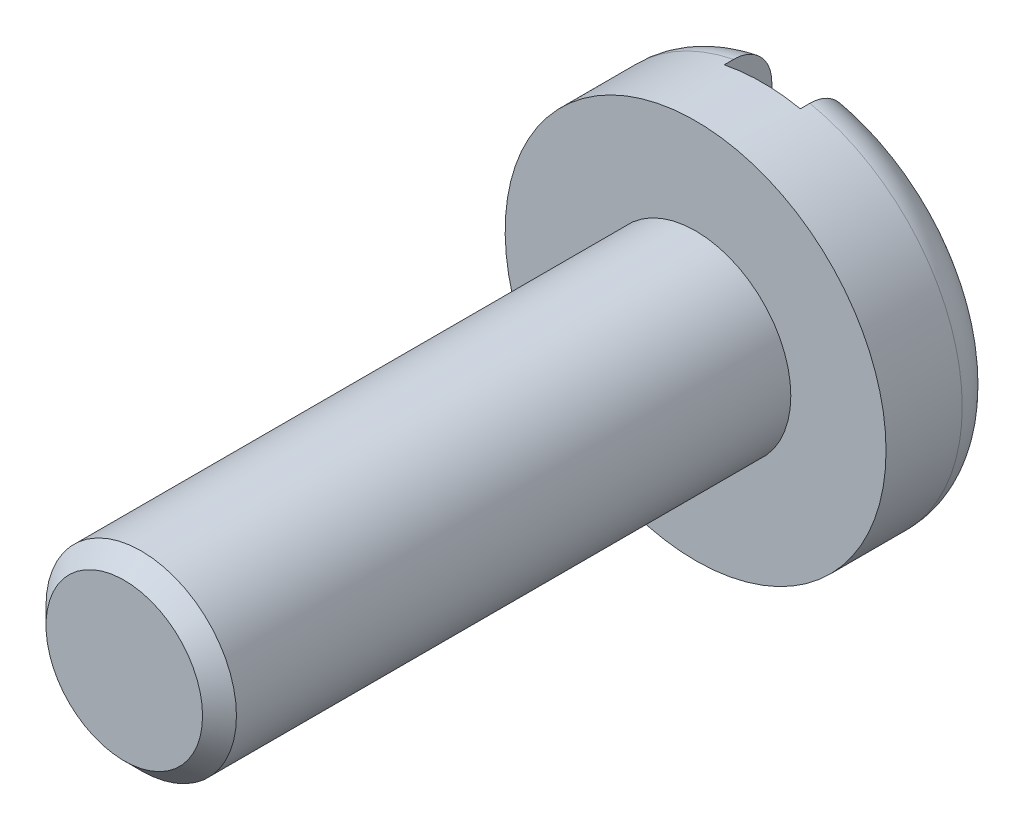
ISO-10303-21;
HEADER;
FILE_DESCRIPTION(('STEP AP214'),'2;1');
FILE_NAME('part.step','',(''),(''),'','','');
FILE_SCHEMA(('AUTOMOTIVE_DESIGN { 1 0 10303 214 1 1 1 1 }'));
ENDSEC;
DATA;
#1=APPLICATION_CONTEXT('core data for automotive mechanical design processes');
#2=APPLICATION_PROTOCOL_DEFINITION('international standard','automotive_design',2000,#1);
#3=PRODUCT_CONTEXT('',#1,'mechanical');
#4=PRODUCT('Part','Part','',(#3));
#5=PRODUCT_RELATED_PRODUCT_CATEGORY('part','',(#4));
#6=PRODUCT_DEFINITION_FORMATION('','',#4);
#7=PRODUCT_DEFINITION_CONTEXT('part definition',#1,'design');
#8=PRODUCT_DEFINITION('design','',#6,#7);
#9=PRODUCT_DEFINITION_SHAPE('','',#8);
#10=(LENGTH_UNIT() NAMED_UNIT(*) SI_UNIT(.MILLI.,.METRE.));
#11=(NAMED_UNIT(*) PLANE_ANGLE_UNIT() SI_UNIT($,.RADIAN.));
#12=(NAMED_UNIT(*) SI_UNIT($,.STERADIAN.) SOLID_ANGLE_UNIT());
#13=UNCERTAINTY_MEASURE_WITH_UNIT(LENGTH_MEASURE(1.E-05),#10,'distance_accuracy_value','');
#14=(GEOMETRIC_REPRESENTATION_CONTEXT(3) GLOBAL_UNCERTAINTY_ASSIGNED_CONTEXT((#13)) GLOBAL_UNIT_ASSIGNED_CONTEXT((#10,
#11,#12)) REPRESENTATION_CONTEXT('',''));
#15=CARTESIAN_POINT('',(0.,0.,0.));
#16=DIRECTION('',(0.,0.,1.));
#17=DIRECTION('',(1.,0.,0.));
#18=AXIS2_PLACEMENT_3D('',#15,#16,#17);
#19=CARTESIAN_POINT('',(0.,0.,0.));
#20=DIRECTION('',(0.,0.,1.));
#21=DIRECTION('',(1.,0.,0.));
#22=AXIS2_PLACEMENT_3D('',#19,#20,#21);
#23=PLANE('',#22);
#24=CARTESIAN_POINT('',(0.,0.,0.));
#25=DIRECTION('',(0.,0.,1.));
#26=DIRECTION('',(1.,0.,0.));
#27=AXIS2_PLACEMENT_3D('',#24,#25,#26);
#28=CIRCLE('',#27,4.);
#29=CARTESIAN_POINT('',(0.999999999999999,3.87298334620742,0.));
#30=VERTEX_POINT('',#29);
#31=CARTESIAN_POINT('',(0.999999999999999,-3.87298334620742,0.));
#32=VERTEX_POINT('',#31);
#33=EDGE_CURVE('E135',#30,#32,#28,.F.);
#34=ORIENTED_EDGE('',*,*,#33,.T.);
#35=DIRECTION('',(0.,1.,0.));
#36=VECTOR('',#35,1.);
#37=CARTESIAN_POINT('',(0.999999999999999,0.,0.));
#38=LINE('',#37,#36);
#39=EDGE_CURVE('E115',#32,#30,#38,.T.);
#40=ORIENTED_EDGE('',*,*,#39,.T.);
#41=EDGE_LOOP('',(#34,#40));
#42=FACE_BOUND('',#41,.T.);
#43=ADVANCED_FACE('F38',(#42),#23,.F.);
#44=CARTESIAN_POINT('',(0.,0.,1.));
#45=DIRECTION('',(0.,0.,1.));
#46=DIRECTION('',(1.,0.,0.));
#47=AXIS2_PLACEMENT_3D('',#44,#45,#46);
#48=TOROIDAL_SURFACE('',#47,4.,1.);
#49=CARTESIAN_POINT('',(0.999999999999999,-4.74089824241527,0.465574839603772));
#50=CARTESIAN_POINT('',(0.999999999999999,-4.77093906909583,0.51206702701001));
#51=CARTESIAN_POINT('',(0.999999999999999,-4.79711067903708,0.561102678447099));
#52=CARTESIAN_POINT('',(0.999999999999999,-4.84088596369063,0.662903994052508));
#53=CARTESIAN_POINT('',(0.999999999999999,-4.85848090806454,0.715673396580716));
#54=CARTESIAN_POINT('',(0.999999999999999,-4.88452978672489,0.823425083640973));
#55=CARTESIAN_POINT('',(0.999999999999999,-4.89298429664504,0.878407228595754));
#56=CARTESIAN_POINT('',(0.999999999999999,-4.90048364927595,0.988997037272202));
#57=CARTESIAN_POINT('',(0.999999999999999,-4.89953057800942,1.04460455959217));
#58=CARTESIAN_POINT('',(0.999999999999999,-4.8882807868657,1.15457059010988));
#59=CARTESIAN_POINT('',(0.999999999999999,-4.87803296373552,1.20893410986675));
#60=CARTESIAN_POINT('',(0.999999999999999,-4.84857983220366,1.31517705937444));
#61=CARTESIAN_POINT('',(0.999999999999999,-4.82937429620127,1.36705642597011));
#62=CARTESIAN_POINT('',(0.999999999999999,-4.78252772145242,1.46703140391835));
#63=CARTESIAN_POINT('',(0.999999999999999,-4.75486299230309,1.51511590558171));
#64=CARTESIAN_POINT('',(0.999999999999999,-4.69195239006159,1.60603553891727));
#65=CARTESIAN_POINT('',(0.999999999999999,-4.65670616379822,1.64887042589909));
#66=CARTESIAN_POINT('',(0.999999999999999,-4.57915929563324,1.72869929202435));
#67=CARTESIAN_POINT('',(0.999999999999999,-4.53677184786283,1.76560890237427));
#68=CARTESIAN_POINT('',(0.999999999999999,-4.44651378239344,1.83196438442698));
#69=CARTESIAN_POINT('',(0.999999999999999,-4.39864266087568,1.86140956952736));
#70=CARTESIAN_POINT('',(0.999999999999999,-4.29768563805518,1.912690559155));
#71=CARTESIAN_POINT('',(0.999999999999999,-4.24450972565911,1.93434908978383));
#72=CARTESIAN_POINT('',(0.999999999999999,-4.13533439460451,1.9686802440512));
#73=CARTESIAN_POINT('',(0.999999999999999,-4.07933461458573,1.98135171450631));
#74=CARTESIAN_POINT('',(0.999999999999999,-3.96457125808458,1.99768568641191));
#75=CARTESIAN_POINT('',(0.999999999999999,-3.90577363084606,2.00110903084919));
#76=CARTESIAN_POINT('',(0.999999999999999,-3.7884126545839,1.99826272601387));
#77=CARTESIAN_POINT('',(0.999999999999999,-3.72984933879538,1.99199174736522));
#78=CARTESIAN_POINT('',(0.999999999999999,-3.613268213964,1.96973618215348));
#79=CARTESIAN_POINT('',(0.999999999999999,-3.55529023657486,1.95354249044896));
#80=CARTESIAN_POINT('',(0.999999999999999,-3.44284084653008,1.91171023463247));
#81=CARTESIAN_POINT('',(0.999999999999999,-3.3883697828002,1.88607073239592));
#82=CARTESIAN_POINT('',(0.999999999999999,-3.28422225313787,1.82582762001542));
#83=CARTESIAN_POINT('',(0.999999999999999,-3.23457377181124,1.79117553669055));
#84=CARTESIAN_POINT('',(0.999999999999999,-3.14196876384408,1.713842252289));
#85=CARTESIAN_POINT('',(0.999999999999999,-3.09901174044189,1.67116164775493));
#86=CARTESIAN_POINT('',(0.999999999999999,-3.02220775407859,1.57998462898422));
#87=CARTESIAN_POINT('',(0.999999999999999,-2.98816883517039,1.5316502178449));
#88=CARTESIAN_POINT('',(0.999999999999999,-2.92919030253011,1.42971369977196));
#89=CARTESIAN_POINT('',(0.999999999999999,-2.90424742518487,1.37611349095908));
#90=CARTESIAN_POINT('',(0.999999999999999,-2.86551921866192,1.26804050353771));
#91=CARTESIAN_POINT('',(0.999999999999999,-2.85123849388488,1.21374526430384));
#92=CARTESIAN_POINT('',(0.999999999999999,-2.83246484792931,1.10349241104978));
#93=CARTESIAN_POINT('',(0.999999999999999,-2.82796880646208,1.04753533275381));
#94=CARTESIAN_POINT('',(0.999999999999999,-2.82893812506757,0.938164760828636));
#95=CARTESIAN_POINT('',(0.999999999999999,-2.83397680054707,0.884746962771905));
#96=CARTESIAN_POINT('',(0.999999999999999,-2.85296958556056,0.779526155630884));
#97=CARTESIAN_POINT('',(0.999999999999999,-2.86692347355491,0.727723106454245));
#98=CARTESIAN_POINT('',(0.999999999999999,-2.90317707406975,0.62720283956641));
#99=CARTESIAN_POINT('',(0.999999999999999,-2.92546742088583,0.578482230394738));
#100=CARTESIAN_POINT('',(0.999999999999999,-2.97760125095634,0.48527139927532));
#101=CARTESIAN_POINT('',(0.999999999999999,-3.00744601755024,0.440781897873544));
#102=CARTESIAN_POINT('',(0.999999999999999,-3.07509259167329,0.355344003704822));
#103=CARTESIAN_POINT('',(0.999999999999999,-3.11316807971552,0.314612481499972));
#104=CARTESIAN_POINT('',(0.999999999999999,-3.19532329186127,0.239740162341416));
#105=CARTESIAN_POINT('',(0.999999999999999,-3.2394044723506,0.20560096890261));
#106=CARTESIAN_POINT('',(0.999999999999999,-3.33470723090834,0.14311767029961));
#107=CARTESIAN_POINT('',(0.999999999999999,-3.38617614939443,0.115150438677534));
#108=CARTESIAN_POINT('',(0.999999999999999,-3.49297945352584,0.067959175273789));
#109=CARTESIAN_POINT('',(0.999999999999999,-3.54831453265273,0.0487367167295342));
#110=CARTESIAN_POINT('',(0.999999999999999,-3.66307362701856,0.0190822643418154));
#111=CARTESIAN_POINT('',(0.999999999999999,-3.72257051102004,0.00893131376428614));
#112=CARTESIAN_POINT('',(0.999999999999999,-3.84242579673291,-0.00125217946359011));
#113=CARTESIAN_POINT('',(0.999999999999999,-3.9027841982355,-0.00128472456621288));
#114=CARTESIAN_POINT('',(0.999999999999999,-4.02269182420806,0.00886219487331795));
#115=CARTESIAN_POINT('',(0.999999999999999,-4.08224035665226,0.0190498972791512));
#116=CARTESIAN_POINT('',(0.999999999999999,-4.19873146910034,0.0494817630717065));
#117=CARTESIAN_POINT('',(0.999999999999999,-4.2556736198033,0.06972757668119));
#118=CARTESIAN_POINT('',(0.999999999999999,-4.36414281303408,0.119321779303109));
#119=CARTESIAN_POINT('',(0.999999999999999,-4.41575180574797,0.148491064083182));
#120=CARTESIAN_POINT('',(0.999999999999999,-4.51311238926742,0.215283374984294));
#121=CARTESIAN_POINT('',(0.999999999999999,-4.55887194720193,0.252894705974579));
#122=CARTESIAN_POINT('',(0.999999999999999,-4.62736160475528,0.320058094017716));
#123=CARTESIAN_POINT('',(0.999999999999999,-4.65231431127167,0.347381814065032));
#124=CARTESIAN_POINT('',(0.999999999999999,-4.69905249332747,0.404617283436022));
#125=CARTESIAN_POINT('',(0.999999999999999,-4.72083802931435,0.43452898334908));
#126=CARTESIAN_POINT('',(0.999999999999999,-4.74089824241527,0.465574839603772));
#127=B_SPLINE_CURVE_WITH_KNOTS('',3,(#49,#50,#51,#52,#53,#54,#55,#56,#57,#58,#59,#60,#61,#62,
#63,#64,#65,#66,#67,#68,#69,#70,#71,#72,#73,#74,#75,#76,#77,#78,#79,#80,#81,#82,#83,#84,#85,#86,
#87,#88,#89,#90,#91,#92,#93,#94,#95,#96,#97,#98,#99,#100,#101,#102,#103,#104,#105,#106,#107,
#108,#109,#110,#111,#112,#113,#114,#115,#116,#117,#118,#119,#120,#121,#122,#123,#124,#125,#126),
.UNSPECIFIED.,.T.,.F.,(4,2,2,2,2,2,2,2,2,2,2,2,2,2,2,2,2,2,2,2,2,2,2,2,2,2,2,2,2,2,2,2,2,2,2,2,
2,2,4),(0.,0.165926564922769,0.332021678524293,0.498106331406758,0.664154157758893,
0.82933349370127,0.99451702680665,1.16016746881096,1.32582562903247,1.49366584887353,
1.66152150161308,1.83298720789472,2.00447491198791,2.18035666144788,2.35626253159434,
2.53600927491765,2.71577387486801,2.89652606583042,3.07726483167773,3.25371559012487,
3.43010297650855,3.59767353069205,3.76519063959225,3.92538799679189,4.08558137330303,
4.24559531645792,4.4056364609326,4.57217005850703,4.73874411274949,4.91367888365498,
5.08864511394687,5.26886084338837,5.44907652915315,5.62943759163489,5.80982825552668,
5.98681257878127,6.16355321494239,6.27435528518346,6.38515524041929),.UNSPECIFIED.);
#128=CARTESIAN_POINT('',(0.999999999999999,-4.89897948556991,1.00000000000064));
#129=VERTEX_POINT('',#128);
#130=EDGE_CURVE('E61',#32,#129,#127,.T.);
#131=ORIENTED_EDGE('',*,*,#130,.F.);
#132=ORIENTED_EDGE('',*,*,#33,.F.);
#133=CARTESIAN_POINT('',(0.999999999999999,2.93448378201662,0.563712357526974));
#134=CARTESIAN_POINT('',(0.999999999999999,2.91000701437085,0.611499699521355));
#135=CARTESIAN_POINT('',(0.999999999999999,2.88943587962965,0.6613192730997));
#136=CARTESIAN_POINT('',(0.999999999999999,2.85688814196943,0.763723114899403));
#137=CARTESIAN_POINT('',(0.999999999999999,2.84491671737472,0.816309028458516));
#138=CARTESIAN_POINT('',(0.999999999999999,2.83006066246026,0.922795059019514));
#139=CARTESIAN_POINT('',(0.999999999999999,2.8271824011816,0.976696070526368));
#140=CARTESIAN_POINT('',(0.999999999999999,2.83065505942636,1.08418986718175));
#141=CARTESIAN_POINT('',(0.999999999999999,2.83700451025153,1.13778270001759));
#142=CARTESIAN_POINT('',(0.999999999999999,2.85852543868406,1.24245417700771));
#143=CARTESIAN_POINT('',(0.999999999999999,2.8735849842021,1.29355596125553));
#144=CARTESIAN_POINT('',(0.999999999999999,2.91186043406805,1.39260230094927));
#145=CARTESIAN_POINT('',(0.999999999999999,2.9350773879355,1.44054644919567));
#146=CARTESIAN_POINT('',(0.999999999999999,2.98954837233285,1.53327223532849));
#147=CARTESIAN_POINT('',(0.999999999999999,3.02099187004184,1.57794236544402));
#148=CARTESIAN_POINT('',(0.999999999999999,3.09059404945473,1.66169746070875));
#149=CARTESIAN_POINT('',(0.999999999999999,3.12875423522928,1.70078117132914));
#150=CARTESIAN_POINT('',(0.999999999999999,3.21277099287321,1.77433657186925));
#151=CARTESIAN_POINT('',(0.999999999999999,3.2589190193294,1.80847544727498));
#152=CARTESIAN_POINT('',(0.999999999999999,3.35610501682304,1.86888755559914));
#153=CARTESIAN_POINT('',(0.999999999999999,3.40714406002746,1.89515905866895));
#154=CARTESIAN_POINT('',(0.999999999999999,3.51493663860159,1.94014213110062));
#155=CARTESIAN_POINT('',(0.999999999999999,3.57183891728481,1.95849801050286));
#156=CARTESIAN_POINT('',(0.999999999999999,3.68790012564205,1.98553945172235));
#157=CARTESIAN_POINT('',(0.999999999999999,3.74705928539265,1.9942240248639));
#158=CARTESIAN_POINT('',(0.999999999999999,3.86678683058724,2.00168514622703));
#159=CARTESIAN_POINT('',(0.999999999999999,3.92736351989617,2.00033007593359));
#160=CARTESIAN_POINT('',(0.999999999999999,4.04740864296231,1.98733987818855));
#161=CARTESIAN_POINT('',(0.999999999999999,4.1068771216297,1.97570516824781));
#162=CARTESIAN_POINT('',(0.999999999999999,4.22221655126588,1.94257877793046));
#163=CARTESIAN_POINT('',(0.999999999999999,4.27812271037955,1.92120988736992));
#164=CARTESIAN_POINT('',(0.999999999999999,4.38541897852354,1.86915599333329));
#165=CARTESIAN_POINT('',(0.999999999999999,4.4368096636758,1.83847218056493));
#166=CARTESIAN_POINT('',(0.999999999999999,4.53224912640572,1.76946640841065));
#167=CARTESIAN_POINT('',(0.999999999999999,4.57644808583963,1.73135219282969));
#168=CARTESIAN_POINT('',(0.999999999999999,4.65761246935788,1.64807163286058));
#169=CARTESIAN_POINT('',(0.999999999999999,4.6945789373752,1.60290630791939));
#170=CARTESIAN_POINT('',(0.999999999999999,4.75925187875461,1.50803971995027));
#171=CARTESIAN_POINT('',(0.999999999999999,4.78716840035085,1.45848160238852));
#172=CARTESIAN_POINT('',(0.999999999999999,4.83410331130973,1.35531690108024));
#173=CARTESIAN_POINT('',(0.999999999999999,4.85312271695606,1.30171078053451));
#174=CARTESIAN_POINT('',(0.999999999999999,4.8813849843533,1.19304353133181));
#175=CARTESIAN_POINT('',(0.999999999999999,4.89080246246899,1.13802776548886));
#176=CARTESIAN_POINT('',(0.999999999999999,4.90017893436993,1.02719713356779));
#177=CARTESIAN_POINT('',(0.999999999999999,4.90013853070775,0.971382318622866));
#178=CARTESIAN_POINT('',(0.999999999999999,4.89064282976504,0.861044631943875));
#179=CARTESIAN_POINT('',(0.999999999999999,4.88126827618146,0.806514785610181));
#180=CARTESIAN_POINT('',(0.999999999999999,4.85351703323853,0.699798298175667));
#181=CARTESIAN_POINT('',(0.999999999999999,4.83514041102996,0.647611639599051));
#182=CARTESIAN_POINT('',(0.999999999999999,4.7898963484848,0.546916340672522));
#183=CARTESIAN_POINT('',(0.999999999999999,4.76300931062551,0.49841651315801));
#184=CARTESIAN_POINT('',(0.999999999999999,4.70157102231077,0.40654588758618));
#185=CARTESIAN_POINT('',(0.999999999999999,4.66701943196387,0.363175317121159));
#186=CARTESIAN_POINT('',(0.999999999999999,4.59078648763996,0.28218375551089));
#187=CARTESIAN_POINT('',(0.999999999999999,4.54902009139599,0.244642852795113));
#188=CARTESIAN_POINT('',(0.999999999999999,4.45989016824042,0.176933955502939));
#189=CARTESIAN_POINT('',(0.999999999999999,4.41252611929278,0.146766649393012));
#190=CARTESIAN_POINT('',(0.999999999999999,4.31248365666993,0.0939644367849335));
#191=CARTESIAN_POINT('',(0.999999999999999,4.25971392738017,0.0715026113786261));
#192=CARTESIAN_POINT('',(0.999999999999999,4.15121403498489,0.0355099340098975));
#193=CARTESIAN_POINT('',(0.999999999999999,4.09548349400933,0.0219802249708486));
#194=CARTESIAN_POINT('',(0.999999999999999,3.98112357390738,0.00387475366064818));
#195=CARTESIAN_POINT('',(0.999999999999999,3.92245650859443,-0.00046302607484398));
#196=CARTESIAN_POINT('',(0.999999999999999,3.80520680768677,0.000541534748304016));
#197=CARTESIAN_POINT('',(0.999999999999999,3.74662418118805,0.0058848500380907));
#198=CARTESIAN_POINT('',(0.999999999999999,3.62983062174308,0.0262748614280143));
#199=CARTESIAN_POINT('',(0.999999999999999,3.57165669553844,0.0415339672258737));
#200=CARTESIAN_POINT('',(0.999999999999999,3.45864282796451,0.0815371173671725));
#201=CARTESIAN_POINT('',(0.999999999999999,3.40380404058364,0.106284423323527));
#202=CARTESIAN_POINT('',(0.999999999999999,3.29868362289936,0.164838892815233));
#203=CARTESIAN_POINT('',(0.999999999999999,3.24843699896355,0.198708947931725));
#204=CARTESIAN_POINT('',(0.999999999999999,3.15454628236655,0.274557510454423));
#205=CARTESIAN_POINT('',(0.999999999999999,3.11089402089954,0.316525836770678));
#206=CARTESIAN_POINT('',(0.999999999999999,3.04452347002882,0.392684680073623));
#207=CARTESIAN_POINT('',(0.999999999999999,3.0196067387943,0.424984987907534));
#208=CARTESIAN_POINT('',(0.999999999999999,2.97387209493399,0.492371194850656));
#209=CARTESIAN_POINT('',(0.999999999999999,2.95305389666677,0.527456899596257));
#210=CARTESIAN_POINT('',(0.999999999999999,2.93448378201662,0.563712357526974));
#211=B_SPLINE_CURVE_WITH_KNOTS('',3,(#133,#134,#135,#136,#137,#138,#139,#140,#141,#142,#143,
#144,#145,#146,#147,#148,#149,#150,#151,#152,#153,#154,#155,#156,#157,#158,#159,#160,#161,#162,
#163,#164,#165,#166,#167,#168,#169,#170,#171,#172,#173,#174,#175,#176,#177,#178,#179,#180,#181,
#182,#183,#184,#185,#186,#187,#188,#189,#190,#191,#192,#193,#194,#195,#196,#197,#198,#199,#200,
#201,#202,#203,#204,#205,#206,#207,#208,#209,#210),.UNSPECIFIED.,.T.,.F.,(4,2,2,2,2,2,2,2,2,2,2,
2,2,2,2,2,2,2,2,2,2,2,2,2,2,2,2,2,2,2,2,2,2,2,2,2,2,2,4),(0.,0.160932429040886,
0.321961682664087,0.483103699555348,0.644220071619469,0.803310565674792,0.962421535566603,
1.12558098044401,1.28877700827265,1.46021890091361,1.63169846193065,1.81023639217772,
1.98879257227755,2.1696937050775,2.3505874908574,2.5292600485585,2.70790977651708,
2.88213979820068,3.05634465305619,3.22615550479707,3.39594695495147,3.56259240299338,
3.72922723421693,3.89443302994594,4.05963759334406,4.22522538681189,4.39082052488689,
4.55852049840211,4.72623612394564,4.89750419570732,5.06879417810633,5.24446731371527,
5.42015813777703,5.59974239479571,5.77938844016696,5.96030613785517,6.14099785176801,
6.26310310975783,6.38519985478011),.UNSPECIFIED.);
#212=CARTESIAN_POINT('',(0.999999999999999,4.898979485567,0.99999999999989));
#213=VERTEX_POINT('',#212);
#214=EDGE_CURVE('E163',#213,#30,#211,.T.);
#215=ORIENTED_EDGE('',*,*,#214,.F.);
#216=CARTESIAN_POINT('',(0.,0.,1.));
#217=DIRECTION('',(0.,0.,1.));
#218=DIRECTION('',(1.,0.,0.));
#219=AXIS2_PLACEMENT_3D('',#216,#217,#218);
#220=CIRCLE('',#219,5.);
#221=EDGE_CURVE('E133',#129,#213,#220,.T.);
#222=ORIENTED_EDGE('',*,*,#221,.F.);
#223=EDGE_LOOP('',(#131,#132,#215,#222));
#224=FACE_BOUND('',#223,.T.);
#225=ADVANCED_FACE('F179',(#224),#48,.T.);
#226=CARTESIAN_POINT('',(0.,0.,3.));
#227=DIRECTION('',(0.,0.,1.));
#228=DIRECTION('',(1.,0.,0.));
#229=AXIS2_PLACEMENT_3D('',#226,#227,#228);
#230=PLANE('',#229);
#231=CARTESIAN_POINT('',(0.,0.,3.));
#232=DIRECTION('',(0.,0.,1.));
#233=DIRECTION('',(1.,0.,0.));
#234=AXIS2_PLACEMENT_3D('',#231,#232,#233);
#235=CIRCLE('',#234,5.);
#236=CARTESIAN_POINT('',(5.,0.,3.));
#237=VERTEX_POINT('',#236);
#238=EDGE_CURVE('E130',#237,#237,#235,.T.);
#239=ORIENTED_EDGE('',*,*,#238,.T.);
#240=EDGE_LOOP('',(#239));
#241=FACE_BOUND('',#240,.T.);
#242=CARTESIAN_POINT('',(0.,0.,3.));
#243=DIRECTION('',(0.,0.,1.));
#244=DIRECTION('',(1.,0.,0.));
#245=AXIS2_PLACEMENT_3D('',#242,#243,#244);
#246=CIRCLE('',#245,2.5);
#247=CARTESIAN_POINT('',(2.5,0.,3.));
#248=VERTEX_POINT('',#247);
#249=EDGE_CURVE('E127',#248,#248,#246,.T.);
#250=ORIENTED_EDGE('',*,*,#249,.F.);
#251=EDGE_LOOP('',(#250));
#252=FACE_BOUND('',#251,.T.);
#253=ADVANCED_FACE('F186',(#241,#252),#230,.T.);
#254=CARTESIAN_POINT('',(0.,0.,3.));
#255=DIRECTION('',(0.,0.,-1.));
#256=DIRECTION('',(-1.,0.,0.));
#257=AXIS2_PLACEMENT_3D('',#254,#255,#256);
#258=CYLINDRICAL_SURFACE('',#257,5.);
#259=ORIENTED_EDGE('',*,*,#221,.T.);
#260=DIRECTION('',(0.,0.,-1.));
#261=VECTOR('',#260,1.);
#262=CARTESIAN_POINT('',(0.999999999999999,4.89897948556636,3.));
#263=LINE('',#262,#261);
#264=CARTESIAN_POINT('',(0.999999999999999,4.89897948556636,1.25));
#265=VERTEX_POINT('',#264);
#266=EDGE_CURVE('E118',#213,#265,#263,.F.);
#267=ORIENTED_EDGE('',*,*,#266,.T.);
#268=CARTESIAN_POINT('',(0.,0.,1.25));
#269=DIRECTION('',(0.,0.,1.));
#270=DIRECTION('',(1.,0.,0.));
#271=AXIS2_PLACEMENT_3D('',#268,#269,#270);
#272=CIRCLE('',#271,5.);
#273=CARTESIAN_POINT('',(-1.,4.89897948556636,1.25));
#274=VERTEX_POINT('',#273);
#275=EDGE_CURVE('E101',#265,#274,#272,.T.);
#276=ORIENTED_EDGE('',*,*,#275,.T.);
#277=DIRECTION('',(0.,0.,-1.));
#278=VECTOR('',#277,1.);
#279=CARTESIAN_POINT('',(-1.,4.89897948556636,3.));
#280=LINE('',#279,#278);
#281=CARTESIAN_POINT('',(-1.,4.89897948556636,1.));
#282=VERTEX_POINT('',#281);
#283=EDGE_CURVE('E107',#274,#282,#280,.T.);
#284=ORIENTED_EDGE('',*,*,#283,.T.);
#285=CARTESIAN_POINT('',(-1.,-4.89897948556636,1.));
#286=VERTEX_POINT('',#285);
#287=EDGE_CURVE('E114',#282,#286,#220,.T.);
#288=ORIENTED_EDGE('',*,*,#287,.T.);
#289=DIRECTION('',(0.,0.,-1.));
#290=VECTOR('',#289,1.);
#291=CARTESIAN_POINT('',(-1.,-4.89897948556636,3.));
#292=LINE('',#291,#290);
#293=CARTESIAN_POINT('',(-1.,-4.89897948556636,1.25));
#294=VERTEX_POINT('',#293);
#295=EDGE_CURVE('E104',#286,#294,#292,.F.);
#296=ORIENTED_EDGE('',*,*,#295,.T.);
#297=CARTESIAN_POINT('',(0.999999999999999,-4.89897948556636,1.25));
#298=VERTEX_POINT('',#297);
#299=EDGE_CURVE('E92',#294,#298,#272,.T.);
#300=ORIENTED_EDGE('',*,*,#299,.T.);
#301=DIRECTION('',(0.,0.,-1.));
#302=VECTOR('',#301,1.);
#303=CARTESIAN_POINT('',(0.999999999999999,-4.89897948556636,3.));
#304=LINE('',#303,#302);
#305=EDGE_CURVE('E125',#298,#129,#304,.T.);
#306=ORIENTED_EDGE('',*,*,#305,.T.);
#307=EDGE_LOOP('',(#259,#267,#276,#284,#288,#296,#300,#306));
#308=FACE_BOUND('',#307,.T.);
#309=ORIENTED_EDGE('',*,*,#238,.F.);
#310=EDGE_LOOP('',(#309));
#311=FACE_BOUND('',#310,.T.);
#312=ADVANCED_FACE('F111',(#308,#311),#258,.T.);
#313=CARTESIAN_POINT('',(-1.,-3.87298334620742,0.));
#314=VERTEX_POINT('',#313);
#315=CARTESIAN_POINT('',(-1.,3.87298334620742,0.));
#316=VERTEX_POINT('',#315);
#317=EDGE_CURVE('E138',#314,#316,#28,.F.);
#318=ORIENTED_EDGE('',*,*,#317,.T.);
#319=DIRECTION('',(0.,-1.,0.));
#320=VECTOR('',#319,1.);
#321=CARTESIAN_POINT('',(-1.,0.,0.));
#322=LINE('',#321,#320);
#323=EDGE_CURVE('E53',#316,#314,#322,.T.);
#324=ORIENTED_EDGE('',*,*,#323,.T.);
#325=EDGE_LOOP('',(#318,#324));
#326=FACE_BOUND('',#325,.T.);
#327=ADVANCED_FACE('F182',(#326),#23,.F.);
#328=CARTESIAN_POINT('',(0.,0.,18.));
#329=DIRECTION('',(0.,0.,-1.));
#330=DIRECTION('',(-1.,0.,0.));
#331=AXIS2_PLACEMENT_3D('',#328,#329,#330);
#332=CYLINDRICAL_SURFACE('',#331,2.5);
#333=CARTESIAN_POINT('',(0.,0.,17.555));
#334=DIRECTION('',(0.,0.,1.));
#335=DIRECTION('',(1.,0.,0.));
#336=AXIS2_PLACEMENT_3D('',#333,#334,#335);
#337=CIRCLE('',#336,2.5);
#338=CARTESIAN_POINT('',(2.5,0.,17.555));
#339=VERTEX_POINT('',#338);
#340=EDGE_CURVE('E11',#339,#339,#337,.F.);
#341=ORIENTED_EDGE('',*,*,#340,.T.);
#342=EDGE_LOOP('',(#341));
#343=FACE_BOUND('',#342,.T.);
#344=ORIENTED_EDGE('',*,*,#249,.T.);
#345=EDGE_LOOP('',(#344));
#346=FACE_BOUND('',#345,.T.);
#347=ADVANCED_FACE('F190',(#343,#346),#332,.T.);
#348=CARTESIAN_POINT('',(0.,0.,18.));
#349=DIRECTION('',(0.,0.,1.));
#350=DIRECTION('',(1.,0.,0.));
#351=AXIS2_PLACEMENT_3D('',#348,#349,#350);
#352=PLANE('',#351);
#353=CARTESIAN_POINT('',(0.,0.,18.));
#354=DIRECTION('',(0.,0.,1.));
#355=DIRECTION('',(1.,0.,0.));
#356=AXIS2_PLACEMENT_3D('',#353,#354,#355);
#357=CIRCLE('',#356,2.055);
#358=CARTESIAN_POINT('',(2.055,0.,18.));
#359=VERTEX_POINT('',#358);
#360=EDGE_CURVE('E46',#359,#359,#357,.T.);
#361=ORIENTED_EDGE('',*,*,#360,.T.);
#362=EDGE_LOOP('',(#361));
#363=FACE_BOUND('',#362,.T.);
#364=ADVANCED_FACE('F160',(#363),#352,.T.);
#365=CARTESIAN_POINT('',(-1.,-4.74089824241527,0.465574839603772));
#366=CARTESIAN_POINT('',(-1.,-4.71006504434273,0.417866026271933));
#367=CARTESIAN_POINT('',(-1.,-4.6751098226035,0.372764712432561));
#368=CARTESIAN_POINT('',(-1.,-4.59804874703975,0.289078184737448));
#369=CARTESIAN_POINT('',(-1.,-4.55593263021828,0.25050248394991));
#370=CARTESIAN_POINT('',(-1.,-4.46591301848721,0.180982646947053));
#371=CARTESIAN_POINT('',(-1.,-4.4180181487066,0.150027341766012));
#372=CARTESIAN_POINT('',(-1.,-4.31780290367036,0.0964434922586625));
#373=CARTESIAN_POINT('',(-1.,-4.2654836242965,0.0738128933726713));
#374=CARTESIAN_POINT('',(-1.,-4.15688639062318,0.0370316594163569));
#375=CARTESIAN_POINT('',(-1.,-4.100553824234,0.0230423784679849));
#376=CARTESIAN_POINT('',(-1.,-3.98635779238308,0.00446334406000498));
#377=CARTESIAN_POINT('',(-1.,-3.92849405595542,-0.000124734279878504));
#378=CARTESIAN_POINT('',(-1.,-3.81132325970972,0.000133100803891473));
#379=CARTESIAN_POINT('',(-1.,-3.75201668849146,0.00522041388350425));
#380=CARTESIAN_POINT('',(-1.,-3.63505192016167,0.0251075472722434));
#381=CARTESIAN_POINT('',(-1.,-3.57739393541042,0.0399086130147861));
#382=CARTESIAN_POINT('',(-1.,-3.46437844977045,0.0791376182469322));
#383=CARTESIAN_POINT('',(-1.,-3.40907452030981,0.103720189003618));
#384=CARTESIAN_POINT('',(-1.,-3.30340159450845,0.161871657843278));
#385=CARTESIAN_POINT('',(-1.,-3.25303282340774,0.195440965819089));
#386=CARTESIAN_POINT('',(-1.,-3.15907642237272,0.270496212732381));
#387=CARTESIAN_POINT('',(-1.,-3.11544937211384,0.311932706167295));
#388=CARTESIAN_POINT('',(-1.,-3.03609367279736,0.401791551777657));
#389=CARTESIAN_POINT('',(-1.,-3.00036340723746,0.450212470854058));
#390=CARTESIAN_POINT('',(-1.,-2.93933307883138,0.550779629106609));
#391=CARTESIAN_POINT('',(-1.,-2.91369391724477,0.602719769865144));
#392=CARTESIAN_POINT('',(-1.,-2.87205799589477,0.710329391598537));
#393=CARTESIAN_POINT('',(-1.,-2.85605738212416,0.765997372076681));
#394=CARTESIAN_POINT('',(-1.,-2.83498204409577,0.876325444742326));
#395=CARTESIAN_POINT('',(-1.,-2.82937690102811,0.930884538794629));
#396=CARTESIAN_POINT('',(-1.,-2.82769992394519,1.04014405336782));
#397=CARTESIAN_POINT('',(-1.,-2.83162626017063,1.09484444475006));
#398=CARTESIAN_POINT('',(-1.,-2.84859525920481,1.20123036890537));
#399=CARTESIAN_POINT('',(-1.,-2.86137990625239,1.2529574342043));
#400=CARTESIAN_POINT('',(-1.,-2.89528700569401,1.35359651128066));
#401=CARTESIAN_POINT('',(-1.,-2.91641009833706,1.40250830656333));
#402=CARTESIAN_POINT('',(-1.,-2.9667328689461,1.4972183763948));
#403=CARTESIAN_POINT('',(-1.,-2.99608376853025,1.54293611620848));
#404=CARTESIAN_POINT('',(-1.,-3.06170309398662,1.62909849046292));
#405=CARTESIAN_POINT('',(-1.,-3.09797302420534,1.66954197494133));
#406=CARTESIAN_POINT('',(-1.,-3.17830644447611,1.74612245657385));
#407=CARTESIAN_POINT('',(-1.,-3.2226659592754,1.78194893303855));
#408=CARTESIAN_POINT('',(-1.,-3.31655627768058,1.84602431985042));
#409=CARTESIAN_POINT('',(-1.,-3.36608826160068,1.8742714953924));
#410=CARTESIAN_POINT('',(-1.,-3.47127383748911,1.92361657425344));
#411=CARTESIAN_POINT('',(-1.,-3.52710083359259,1.94434551083178));
#412=CARTESIAN_POINT('',(-1.,-3.64141105479511,1.97631862744627));
#413=CARTESIAN_POINT('',(-1.,-3.6998946016246,1.98756165541496));
#414=CARTESIAN_POINT('',(-1.,-3.81893144312851,2.00033263679753));
#415=CARTESIAN_POINT('',(-1.,-3.87950302789219,2.00169137816073));
#416=CARTESIAN_POINT('',(-1.,-4.00000385585722,1.99412019775753));
#417=CARTESIAN_POINT('',(-1.,-4.05993311497126,1.98519053146902));
#418=CARTESIAN_POINT('',(-1.,-4.17681480607959,1.95731903796157));
#419=CARTESIAN_POINT('',(-1.,-4.23379025683181,1.93847395148709));
#420=CARTESIAN_POINT('',(-1.,-4.34364912247139,1.89125448589588));
#421=CARTESIAN_POINT('',(-1.,-4.39653302124242,1.86288123574483));
#422=CARTESIAN_POINT('',(-1.,-4.49534674402833,1.79812484434942));
#423=CARTESIAN_POINT('',(-1.,-4.54141243920482,1.76194908554623));
#424=CARTESIAN_POINT('',(-1.,-4.62661329720358,1.68219110958364));
#425=CARTESIAN_POINT('',(-1.,-4.66574945575197,1.63860995829406));
#426=CARTESIAN_POINT('',(-1.,-4.7349228851927,1.5464891936478));
#427=CARTESIAN_POINT('',(-1.,-4.76516784088004,1.49810548543352));
#428=CARTESIAN_POINT('',(-1.,-4.81691403011862,1.39687081421513));
#429=CARTESIAN_POINT('',(-1.,-4.8384166751572,1.34402057401933));
#430=CARTESIAN_POINT('',(-1.,-4.87165265434677,1.23648060002816));
#431=CARTESIAN_POINT('',(-1.,-4.8835707874061,1.18184791788991));
#432=CARTESIAN_POINT('',(-1.,-4.89796541764309,1.07133733509905));
#433=CARTESIAN_POINT('',(-1.,-4.90044008644339,1.01545919541594));
#434=CARTESIAN_POINT('',(-1.,-4.89588896522175,0.904630696825418));
#435=CARTESIAN_POINT('',(-1.,-4.88895305291438,0.849676564845942));
#436=CARTESIAN_POINT('',(-1.,-4.86595745745963,0.74176350309161));
#437=CARTESIAN_POINT('',(-1.,-4.84990954904813,0.688802092266979));
#438=CARTESIAN_POINT('',(-1.,-4.81765133809098,0.607554539037998));
#439=CARTESIAN_POINT('',(-1.,-4.80425205205763,0.578120576034035));
#440=CARTESIAN_POINT('',(-1.,-4.77464592147788,0.520701401782338));
#441=CARTESIAN_POINT('',(-1.,-4.75843911229441,0.49271617229244));
#442=CARTESIAN_POINT('',(-1.,-4.74089824241527,0.465574839603772));
#443=B_SPLINE_CURVE_WITH_KNOTS('',3,(#365,#366,#367,#368,#369,#370,#371,#372,#373,#374,#375,
#376,#377,#378,#379,#380,#381,#382,#383,#384,#385,#386,#387,#388,#389,#390,#391,#392,#393,#394,
#395,#396,#397,#398,#399,#400,#401,#402,#403,#404,#405,#406,#407,#408,#409,#410,#411,#412,#413,
#414,#415,#416,#417,#418,#419,#420,#421,#422,#423,#424,#425,#426,#427,#428,#429,#430,#431,#432,
#433,#434,#435,#436,#437,#438,#439,#440,#441,#442),.UNSPECIFIED.,.T.,.F.,(4,2,2,2,2,2,2,2,2,2,2,
2,2,2,2,2,2,2,2,2,2,2,2,2,2,2,2,2,2,2,2,2,2,2,2,2,2,2,4),(0.,0.170293975521392,
0.340834106060492,0.511122773064458,0.68136938412942,0.854705746974298,1.02807299245539,
1.20582253507193,1.38359487201804,1.56429690126109,1.74500717388422,1.92461717711484,
2.10419037936075,2.27707097357381,2.44988239490902,2.61360418079543,2.77729453947537,
2.93640717223626,3.09553202448444,3.25779845849846,3.4201002130282,3.59040174897868,
3.76074223158909,3.9385726074352,4.11642457774518,4.29731423662401,4.47819940381492,
4.65735160743837,4.83648259129972,5.01133733756505,5.18616693799579,5.35651100318811,
5.52682755459428,5.69377572556944,5.86075621823952,6.02615310412188,6.19133674509111,
6.28821745404154,6.38509694279247),.UNSPECIFIED.);
#444=EDGE_CURVE('E144',#286,#314,#443,.T.);
#445=ORIENTED_EDGE('',*,*,#444,.F.);
#446=ORIENTED_EDGE('',*,*,#287,.F.);
#447=CARTESIAN_POINT('',(-1.,2.93448378201662,0.56371235752696));
#448=CARTESIAN_POINT('',(-1.,2.96069908956071,0.512541844199813));
#449=CARTESIAN_POINT('',(-1.,2.99143461862511,0.463625749821992));
#450=CARTESIAN_POINT('',(-1.,3.06079531157116,0.371670420886448));
#451=CARTESIAN_POINT('',(-1.,3.09943509034507,0.328642322758626));
#452=CARTESIAN_POINT('',(-1.,3.18319773931919,0.249679976967479));
#453=CARTESIAN_POINT('',(-1.,3.22830410939954,0.21372821117273));
#454=CARTESIAN_POINT('',(-1.,3.32372370649943,0.149628128185224));
#455=CARTESIAN_POINT('',(-1.,3.37403533766735,0.121477428986453));
#456=CARTESIAN_POINT('',(-1.,3.48026367685224,0.0728033443089894));
#457=CARTESIAN_POINT('',(-1.,3.53631126943571,0.0525652722254238));
#458=CARTESIAN_POINT('',(-1.,3.65098426925227,0.0216085537951601));
#459=CARTESIAN_POINT('',(-1.,3.70961014211835,0.0108916344230947));
#460=CARTESIAN_POINT('',(-1.,3.82880493604301,-0.00078733170479495));
#461=CARTESIAN_POINT('',(-1.,3.88938995532964,-0.00158638430060832));
#462=CARTESIAN_POINT('',(-1.,4.0098215138411,0.00710473460345341));
#463=CARTESIAN_POINT('',(-1.,4.06966807498175,0.0165946000045844));
#464=CARTESIAN_POINT('',(-1.,4.18625445283549,0.045557850031344));
#465=CARTESIAN_POINT('',(-1.,4.24301964658742,0.0649288751755898));
#466=CARTESIAN_POINT('',(-1.,4.35236914421765,0.113158064989272));
#467=CARTESIAN_POINT('',(-1.,4.40495397158308,0.142015039447727));
#468=CARTESIAN_POINT('',(-1.,4.50308682404843,0.207663469722826));
#469=CARTESIAN_POINT('',(-1.,4.54877374634852,0.244247250399062));
#470=CARTESIAN_POINT('',(-1.,4.63315296623722,0.324749201993156));
#471=CARTESIAN_POINT('',(-1.,4.67184626736106,0.368666318886383));
#472=CARTESIAN_POINT('',(-1.,4.74009804769514,0.461370974058742));
#473=CARTESIAN_POINT('',(-1.,4.76986497533992,0.510005092771624));
#474=CARTESIAN_POINT('',(-1.,4.82062279255562,0.611655891079577));
#475=CARTESIAN_POINT('',(-1.,4.84161473007484,0.664672046446099));
#476=CARTESIAN_POINT('',(-1.,4.87382749717557,0.772469080638745));
#477=CARTESIAN_POINT('',(-1.,4.88523031909315,0.827195628337143));
#478=CARTESIAN_POINT('',(-1.,4.89858646288883,0.937788961170139));
#479=CARTESIAN_POINT('',(-1.,4.90054043785865,0.993655667230462));
#480=CARTESIAN_POINT('',(-1.,4.89496542939565,1.10436791911557));
#481=CARTESIAN_POINT('',(-1.,4.88752819543608,1.15921811403541));
#482=CARTESIAN_POINT('',(-1.,4.8635597577315,1.26689203249944));
#483=CARTESIAN_POINT('',(-1.,4.84702867887301,1.3197157838623));
#484=CARTESIAN_POINT('',(-1.,4.80535729828216,1.42192006707087));
#485=CARTESIAN_POINT('',(-1.,4.78020688240256,1.47129647140678));
#486=CARTESIAN_POINT('',(-1.,4.7220644150698,1.56519005706479));
#487=CARTESIAN_POINT('',(-1.,4.68907204933344,1.60970704353077));
#488=CARTESIAN_POINT('',(-1.,4.61579470420978,1.69319534608683));
#489=CARTESIAN_POINT('',(-1.,4.57542903075492,1.73209579822611));
#490=CARTESIAN_POINT('',(-1.,4.48885410382951,1.80272927254914));
#491=CARTESIAN_POINT('',(-1.,4.44264434198905,1.834461670523));
#492=CARTESIAN_POINT('',(-1.,4.3446951889382,1.89056684638817));
#493=CARTESIAN_POINT('',(-1.,4.29286208439692,1.91477595067732));
#494=CARTESIAN_POINT('',(-1.,4.18593682615196,1.95439075932937));
#495=CARTESIAN_POINT('',(-1.,4.13084426980528,1.9697953735495));
#496=CARTESIAN_POINT('',(-1.,4.01747245086688,1.99177646878197));
#497=CARTESIAN_POINT('',(-1.,3.95914779107884,1.99811881708663));
#498=CARTESIAN_POINT('',(-1.,3.84224743021022,2.00116065784692));
#499=CARTESIAN_POINT('',(-1.,3.78367169582827,1.99785882897307));
#500=CARTESIAN_POINT('',(-1.,3.66649665687417,1.98157959721558));
#501=CARTESIAN_POINT('',(-1.,3.60792810098181,1.96838032073936));
#502=CARTESIAN_POINT('',(-1.,3.49379367510806,1.93242992628882));
#503=CARTESIAN_POINT('',(-1.,3.43822814401251,1.90967773281517));
#504=CARTESIAN_POINT('',(-1.,3.33119938447256,1.85495868431804));
#505=CARTESIAN_POINT('',(-1.,3.27977720845297,1.82291137784138));
#506=CARTESIAN_POINT('',(-1.,3.18316541249466,1.75048575915997));
#507=CARTESIAN_POINT('',(-1.,3.13797558898911,1.71010771916887));
#508=CARTESIAN_POINT('',(-1.,3.05612598496546,1.62288795045319));
#509=CARTESIAN_POINT('',(-1.,3.01932190714165,1.57618189858792));
#510=CARTESIAN_POINT('',(-1.,2.95454007779371,1.47700265195269));
#511=CARTESIAN_POINT('',(-1.,2.92655907199995,1.42453159317833));
#512=CARTESIAN_POINT('',(-1.,2.88167927414817,1.3179722125554));
#513=CARTESIAN_POINT('',(-1.,2.86431717887304,1.26407912220534));
#514=CARTESIAN_POINT('',(-1.,2.83939489159018,1.15405860410064));
#515=CARTESIAN_POINT('',(-1.,2.83183396113153,1.09793134500383));
#516=CARTESIAN_POINT('',(-1.,2.82697258396262,0.987894248723951));
#517=CARTESIAN_POINT('',(-1.,2.82920659857394,0.934004177197779));
#518=CARTESIAN_POINT('',(-1.,2.84278988982708,0.827438546894397));
#519=CARTESIAN_POINT('',(-1.,2.85412657859915,0.77476141418579));
#520=CARTESIAN_POINT('',(-1.,2.87814706416014,0.695923528291643));
#521=CARTESIAN_POINT('',(-1.,2.88776979136517,0.668791436536003));
#522=CARTESIAN_POINT('',(-1.,2.90937910122904,0.615488893131905));
#523=CARTESIAN_POINT('',(-1.,2.92136549700588,0.589318365651893));
#524=CARTESIAN_POINT('',(-1.,2.93448378201662,0.56371235752696));
#525=B_SPLINE_CURVE_WITH_KNOTS('',3,(#447,#448,#449,#450,#451,#452,#453,#454,#455,#456,#457,
#458,#459,#460,#461,#462,#463,#464,#465,#466,#467,#468,#469,#470,#471,#472,#473,#474,#475,#476,
#477,#478,#479,#480,#481,#482,#483,#484,#485,#486,#487,#488,#489,#490,#491,#492,#493,#494,#495,
#496,#497,#498,#499,#500,#501,#502,#503,#504,#505,#506,#507,#508,#509,#510,#511,#512,#513,#514,
#515,#516,#517,#518,#519,#520,#521,#522,#523,#524),.UNSPECIFIED.,.T.,.F.,(4,2,2,2,2,2,2,2,2,2,2,
2,2,2,2,2,2,2,2,2,2,2,2,2,2,2,2,2,2,2,2,2,2,2,2,2,2,2,4),(0.,0.172373444393884,
0.345068534386002,0.517330570274521,0.689539948944809,0.867485853892042,1.04546402860421,
1.22636336687485,1.40725732347748,1.58631433376038,1.76534888616161,1.94007458659391,
2.11477519518339,2.28500456623333,2.4552136019234,2.62211424654521,2.78900335505205,
2.95427454695264,3.11954346922707,3.28500699002192,3.45047714324579,3.61788042521346,
3.78529827941156,3.95613787170724,4.12699861221483,4.30219849876801,4.47742239023443,
4.65669634048954,4.83599047941919,5.01688528545629,5.1977741815411,5.37526489802213,
5.55269007269335,5.72168691530388,5.89067102441494,6.05171291512221,6.21253248762318,
6.29879593101046,6.38505255676393),.UNSPECIFIED.);
#526=EDGE_CURVE('E139',#316,#282,#525,.T.);
#527=ORIENTED_EDGE('',*,*,#526,.F.);
#528=ORIENTED_EDGE('',*,*,#317,.F.);
#529=EDGE_LOOP('',(#445,#446,#527,#528));
#530=FACE_BOUND('',#529,.T.);
#531=ADVANCED_FACE('F148',(#530),#48,.T.);
#532=CARTESIAN_POINT('',(-1.,-5.,1.25));
#533=DIRECTION('',(0.,0.,1.));
#534=DIRECTION('',(1.,0.,0.));
#535=AXIS2_PLACEMENT_3D('',#532,#533,#534);
#536=PLANE('',#535);
#537=DIRECTION('',(0.,1.,0.));
#538=VECTOR('',#537,1.);
#539=CARTESIAN_POINT('',(0.999999999999999,-5.,1.25));
#540=LINE('',#539,#538);
#541=EDGE_CURVE('E98',#298,#265,#540,.T.);
#542=ORIENTED_EDGE('',*,*,#541,.F.);
#543=ORIENTED_EDGE('',*,*,#299,.F.);
#544=DIRECTION('',(0.,1.,0.));
#545=VECTOR('',#544,1.);
#546=CARTESIAN_POINT('',(-1.,-5.,1.25));
#547=LINE('',#546,#545);
#548=EDGE_CURVE('E95',#294,#274,#547,.T.);
#549=ORIENTED_EDGE('',*,*,#548,.T.);
#550=ORIENTED_EDGE('',*,*,#275,.F.);
#551=EDGE_LOOP('',(#542,#543,#549,#550));
#552=FACE_BOUND('',#551,.T.);
#553=ADVANCED_FACE('F94',(#552),#536,.F.);
#554=CARTESIAN_POINT('',(0.999999999999999,-5.,1.25));
#555=DIRECTION('',(1.,0.,0.));
#556=DIRECTION('',(0.,0.,-1.));
#557=AXIS2_PLACEMENT_3D('',#554,#555,#556);
#558=PLANE('',#557);
#559=ORIENTED_EDGE('',*,*,#541,.T.);
#560=ORIENTED_EDGE('',*,*,#266,.F.);
#561=ORIENTED_EDGE('',*,*,#214,.T.);
#562=ORIENTED_EDGE('',*,*,#39,.F.);
#563=ORIENTED_EDGE('',*,*,#130,.T.);
#564=ORIENTED_EDGE('',*,*,#305,.F.);
#565=EDGE_LOOP('',(#559,#560,#561,#562,#563,#564));
#566=FACE_BOUND('',#565,.T.);
#567=ADVANCED_FACE('F155',(#566),#558,.F.);
#568=CARTESIAN_POINT('',(-1.,-5.,1.25));
#569=DIRECTION('',(-1.,0.,0.));
#570=DIRECTION('',(0.,0.,1.));
#571=AXIS2_PLACEMENT_3D('',#568,#569,#570);
#572=PLANE('',#571);
#573=ORIENTED_EDGE('',*,*,#444,.T.);
#574=ORIENTED_EDGE('',*,*,#323,.F.);
#575=ORIENTED_EDGE('',*,*,#526,.T.);
#576=ORIENTED_EDGE('',*,*,#283,.F.);
#577=ORIENTED_EDGE('',*,*,#548,.F.);
#578=ORIENTED_EDGE('',*,*,#295,.F.);
#579=EDGE_LOOP('',(#573,#574,#575,#576,#577,#578));
#580=FACE_BOUND('',#579,.T.);
#581=ADVANCED_FACE('F103',(#580),#572,.F.);
#582=CARTESIAN_POINT('',(0.,0.,18.));
#583=DIRECTION('',(0.,0.,-1.));
#584=DIRECTION('',(-1.,0.,0.));
#585=AXIS2_PLACEMENT_3D('',#582,#583,#584);
#586=CONICAL_SURFACE('',#585,2.055,0.785398163397446);
#587=ORIENTED_EDGE('',*,*,#340,.F.);
#588=EDGE_LOOP('',(#587));
#589=FACE_BOUND('',#588,.T.);
#590=ORIENTED_EDGE('',*,*,#360,.F.);
#591=EDGE_LOOP('',(#590));
#592=FACE_BOUND('',#591,.T.);
#593=ADVANCED_FACE('F40',(#589,#592),#586,.T.);
#594=CLOSED_SHELL('',(#43,#225,#253,#312,#327,#347,#364,#531,#553,#567,#581,#593));
#595=MANIFOLD_SOLID_BREP('B2',#594);
#596=ADVANCED_BREP_SHAPE_REPRESENTATION('',(#18,#595),#14);
#597=SHAPE_DEFINITION_REPRESENTATION(#9,#596);
ENDSEC;
END-ISO-10303-21;
